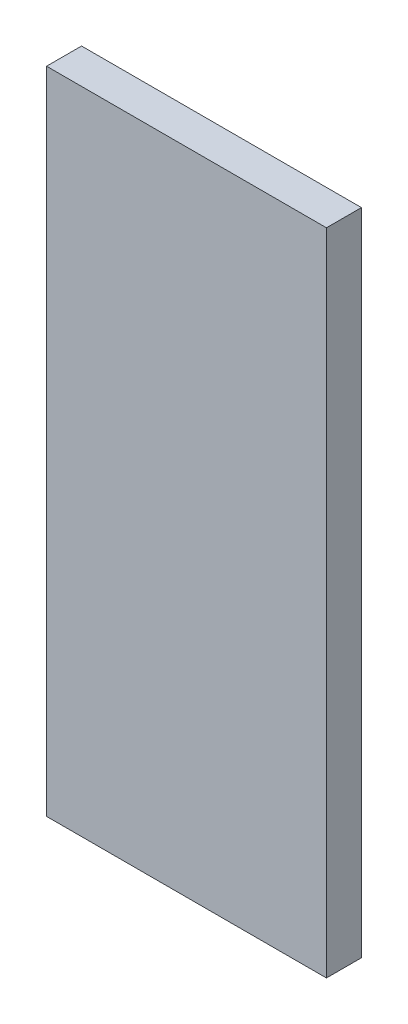
ISO-10303-21;
HEADER;
FILE_DESCRIPTION(('STEP AP214'),'2;1');
FILE_NAME('part.step','',(''),(''),'','','');
FILE_SCHEMA(('AUTOMOTIVE_DESIGN { 1 0 10303 214 1 1 1 1 }'));
ENDSEC;
DATA;
#1=APPLICATION_CONTEXT('core data for automotive mechanical design processes');
#2=APPLICATION_PROTOCOL_DEFINITION('international standard','automotive_design',2000,#1);
#3=PRODUCT_CONTEXT('',#1,'mechanical');
#4=PRODUCT('Part','Part','',(#3));
#5=PRODUCT_RELATED_PRODUCT_CATEGORY('part','',(#4));
#6=PRODUCT_DEFINITION_FORMATION('','',#4);
#7=PRODUCT_DEFINITION_CONTEXT('part definition',#1,'design');
#8=PRODUCT_DEFINITION('design','',#6,#7);
#9=PRODUCT_DEFINITION_SHAPE('','',#8);
#10=(LENGTH_UNIT() NAMED_UNIT(*) SI_UNIT(.MILLI.,.METRE.));
#11=(NAMED_UNIT(*) PLANE_ANGLE_UNIT() SI_UNIT($,.RADIAN.));
#12=(NAMED_UNIT(*) SI_UNIT($,.STERADIAN.) SOLID_ANGLE_UNIT());
#13=UNCERTAINTY_MEASURE_WITH_UNIT(LENGTH_MEASURE(1.E-05),#10,'distance_accuracy_value','');
#14=(GEOMETRIC_REPRESENTATION_CONTEXT(3) GLOBAL_UNCERTAINTY_ASSIGNED_CONTEXT((#13)) GLOBAL_UNIT_ASSIGNED_CONTEXT((#10,
#11,#12)) REPRESENTATION_CONTEXT('',''));
#15=CARTESIAN_POINT('',(0.,0.,0.));
#16=DIRECTION('',(0.,0.,1.));
#17=DIRECTION('',(1.,0.,0.));
#18=AXIS2_PLACEMENT_3D('',#15,#16,#17);
#19=CARTESIAN_POINT('',(0.,0.,-35.));
#20=DIRECTION('',(-1.,0.,0.));
#21=DIRECTION('',(0.,-1.,0.));
#22=AXIS2_PLACEMENT_3D('',#19,#20,#21);
#23=PLANE('',#22);
#24=DIRECTION('',(0.,-1.,0.));
#25=VECTOR('',#24,1.);
#26=CARTESIAN_POINT('',(0.,0.,0.));
#27=LINE('',#26,#25);
#28=CARTESIAN_POINT('',(0.,0.,0.));
#29=VERTEX_POINT('',#28);
#30=CARTESIAN_POINT('',(0.,-650.,0.));
#31=VERTEX_POINT('',#30);
#32=EDGE_CURVE('E103',#29,#31,#27,.T.);
#33=ORIENTED_EDGE('',*,*,#32,.F.);
#34=DIRECTION('',(0.,0.,1.));
#35=VECTOR('',#34,1.);
#36=CARTESIAN_POINT('',(0.,0.,-35.));
#37=LINE('',#36,#35);
#38=CARTESIAN_POINT('',(0.,0.,-35.));
#39=VERTEX_POINT('',#38);
#40=EDGE_CURVE('E11',#39,#29,#37,.T.);
#41=ORIENTED_EDGE('',*,*,#40,.F.);
#42=DIRECTION('',(0.,-1.,0.));
#43=VECTOR('',#42,1.);
#44=CARTESIAN_POINT('',(0.,0.,-35.));
#45=LINE('',#44,#43);
#46=CARTESIAN_POINT('',(0.,-650.,-35.));
#47=VERTEX_POINT('',#46);
#48=EDGE_CURVE('E97',#39,#47,#45,.T.);
#49=ORIENTED_EDGE('',*,*,#48,.T.);
#50=DIRECTION('',(0.,0.,1.));
#51=VECTOR('',#50,1.);
#52=CARTESIAN_POINT('',(0.,-650.,-35.));
#53=LINE('',#52,#51);
#54=EDGE_CURVE('E42',#47,#31,#53,.T.);
#55=ORIENTED_EDGE('',*,*,#54,.T.);
#56=EDGE_LOOP('',(#33,#41,#49,#55));
#57=FACE_BOUND('',#56,.T.);
#58=ADVANCED_FACE('F39',(#57),#23,.T.);
#59=CARTESIAN_POINT('',(0.,0.,-35.));
#60=DIRECTION('',(0.,1.,0.));
#61=DIRECTION('',(0.,0.,1.));
#62=AXIS2_PLACEMENT_3D('',#59,#60,#61);
#63=PLANE('',#62);
#64=DIRECTION('',(-1.,0.,0.));
#65=VECTOR('',#64,1.);
#66=CARTESIAN_POINT('',(0.,0.,0.));
#67=LINE('',#66,#65);
#68=CARTESIAN_POINT('',(280.,0.,0.));
#69=VERTEX_POINT('',#68);
#70=EDGE_CURVE('E99',#69,#29,#67,.T.);
#71=ORIENTED_EDGE('',*,*,#70,.F.);
#72=DIRECTION('',(0.,0.,1.));
#73=VECTOR('',#72,1.);
#74=CARTESIAN_POINT('',(280.,0.,-35.));
#75=LINE('',#74,#73);
#76=CARTESIAN_POINT('',(280.,0.,-35.));
#77=VERTEX_POINT('',#76);
#78=EDGE_CURVE('E48',#77,#69,#75,.T.);
#79=ORIENTED_EDGE('',*,*,#78,.F.);
#80=DIRECTION('',(-1.,0.,0.));
#81=VECTOR('',#80,1.);
#82=CARTESIAN_POINT('',(0.,0.,-35.));
#83=LINE('',#82,#81);
#84=EDGE_CURVE('E94',#77,#39,#83,.T.);
#85=ORIENTED_EDGE('',*,*,#84,.T.);
#86=ORIENTED_EDGE('',*,*,#40,.T.);
#87=EDGE_LOOP('',(#71,#79,#85,#86));
#88=FACE_BOUND('',#87,.T.);
#89=ADVANCED_FACE('F113',(#88),#63,.T.);
#90=CARTESIAN_POINT('',(280.,0.,-35.));
#91=DIRECTION('',(1.,0.,0.));
#92=DIRECTION('',(0.,1.,0.));
#93=AXIS2_PLACEMENT_3D('',#90,#91,#92);
#94=PLANE('',#93);
#95=DIRECTION('',(0.,1.,0.));
#96=VECTOR('',#95,1.);
#97=CARTESIAN_POINT('',(280.,0.,0.));
#98=LINE('',#97,#96);
#99=CARTESIAN_POINT('',(280.,-650.,0.));
#100=VERTEX_POINT('',#99);
#101=EDGE_CURVE('E89',#100,#69,#98,.T.);
#102=ORIENTED_EDGE('',*,*,#101,.F.);
#103=DIRECTION('',(0.,0.,1.));
#104=VECTOR('',#103,1.);
#105=CARTESIAN_POINT('',(280.,-650.,-35.));
#106=LINE('',#105,#104);
#107=CARTESIAN_POINT('',(280.,-650.,-35.));
#108=VERTEX_POINT('',#107);
#109=EDGE_CURVE('E84',#108,#100,#106,.T.);
#110=ORIENTED_EDGE('',*,*,#109,.F.);
#111=DIRECTION('',(0.,1.,0.));
#112=VECTOR('',#111,1.);
#113=CARTESIAN_POINT('',(280.,0.,-35.));
#114=LINE('',#113,#112);
#115=EDGE_CURVE('E87',#108,#77,#114,.T.);
#116=ORIENTED_EDGE('',*,*,#115,.T.);
#117=ORIENTED_EDGE('',*,*,#78,.T.);
#118=EDGE_LOOP('',(#102,#110,#116,#117));
#119=FACE_BOUND('',#118,.T.);
#120=ADVANCED_FACE('F86',(#119),#94,.T.);
#121=CARTESIAN_POINT('',(0.,-650.,-35.));
#122=DIRECTION('',(0.,-1.,0.));
#123=DIRECTION('',(1.,0.,0.));
#124=AXIS2_PLACEMENT_3D('',#121,#122,#123);
#125=PLANE('',#124);
#126=DIRECTION('',(1.,0.,0.));
#127=VECTOR('',#126,1.);
#128=CARTESIAN_POINT('',(0.,-650.,0.));
#129=LINE('',#128,#127);
#130=EDGE_CURVE('E106',#31,#100,#129,.T.);
#131=ORIENTED_EDGE('',*,*,#130,.F.);
#132=ORIENTED_EDGE('',*,*,#54,.F.);
#133=DIRECTION('',(1.,0.,0.));
#134=VECTOR('',#133,1.);
#135=CARTESIAN_POINT('',(0.,-650.,-35.));
#136=LINE('',#135,#134);
#137=EDGE_CURVE('E93',#47,#108,#136,.T.);
#138=ORIENTED_EDGE('',*,*,#137,.T.);
#139=ORIENTED_EDGE('',*,*,#109,.T.);
#140=EDGE_LOOP('',(#131,#132,#138,#139));
#141=FACE_BOUND('',#140,.T.);
#142=ADVANCED_FACE('F96',(#141),#125,.T.);
#143=CARTESIAN_POINT('',(0.,0.,-35.));
#144=DIRECTION('',(0.,0.,1.));
#145=DIRECTION('',(1.,0.,0.));
#146=AXIS2_PLACEMENT_3D('',#143,#144,#145);
#147=PLANE('',#146);
#148=ORIENTED_EDGE('',*,*,#48,.F.);
#149=ORIENTED_EDGE('',*,*,#84,.F.);
#150=ORIENTED_EDGE('',*,*,#115,.F.);
#151=ORIENTED_EDGE('',*,*,#137,.F.);
#152=EDGE_LOOP('',(#148,#149,#150,#151));
#153=FACE_BOUND('',#152,.T.);
#154=ADVANCED_FACE('F92',(#153),#147,.F.);
#155=CARTESIAN_POINT('',(0.,0.,0.));
#156=DIRECTION('',(0.,0.,1.));
#157=DIRECTION('',(1.,0.,0.));
#158=AXIS2_PLACEMENT_3D('',#155,#156,#157);
#159=PLANE('',#158);
#160=ORIENTED_EDGE('',*,*,#32,.T.);
#161=ORIENTED_EDGE('',*,*,#130,.T.);
#162=ORIENTED_EDGE('',*,*,#101,.T.);
#163=ORIENTED_EDGE('',*,*,#70,.T.);
#164=EDGE_LOOP('',(#160,#161,#162,#163));
#165=FACE_BOUND('',#164,.T.);
#166=ADVANCED_FACE('F112',(#165),#159,.T.);
#167=CLOSED_SHELL('',(#58,#89,#120,#142,#154,#166));
#168=MANIFOLD_SOLID_BREP('B2',#167);
#169=ADVANCED_BREP_SHAPE_REPRESENTATION('',(#18,#168),#14);
#170=SHAPE_DEFINITION_REPRESENTATION(#9,#169);
ENDSEC;
END-ISO-10303-21;
